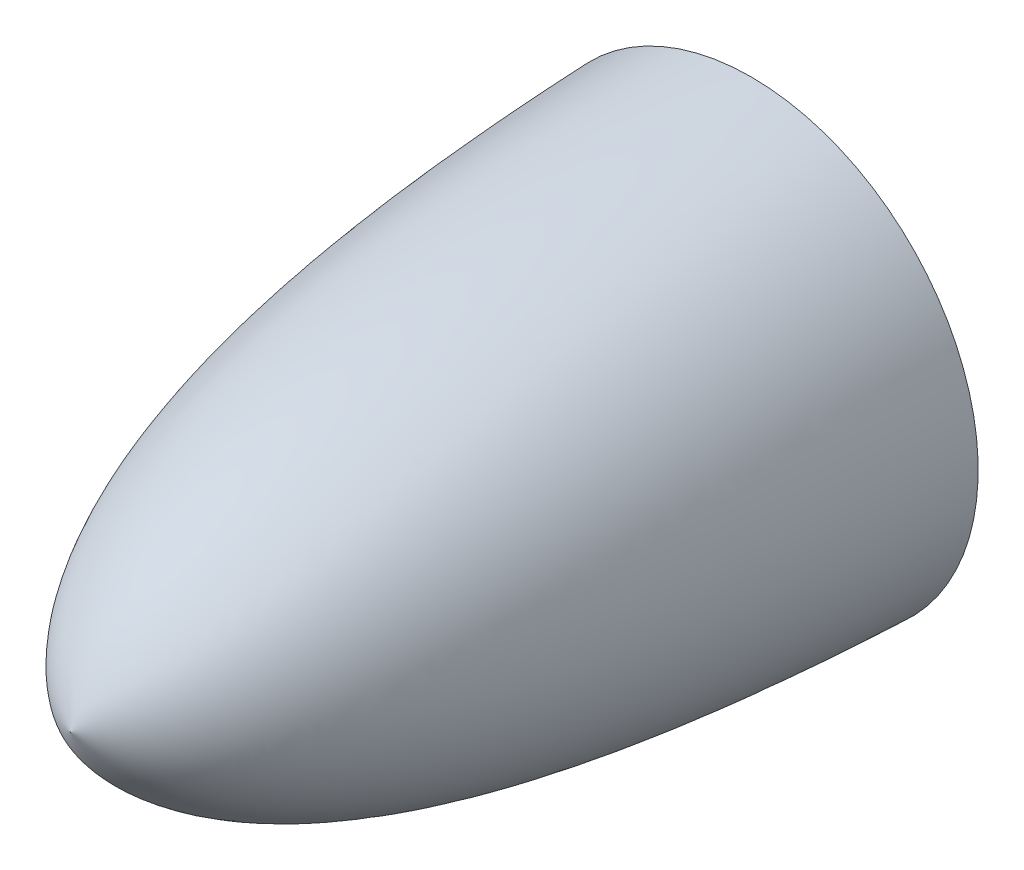
ISO-10303-21;
HEADER;
FILE_DESCRIPTION(('STEP AP214'),'2;1');
FILE_NAME('part.step','',(''),(''),'','','');
FILE_SCHEMA(('AUTOMOTIVE_DESIGN { 1 0 10303 214 1 1 1 1 }'));
ENDSEC;
DATA;
#1=APPLICATION_CONTEXT('core data for automotive mechanical design processes');
#2=APPLICATION_PROTOCOL_DEFINITION('international standard','automotive_design',2000,#1);
#3=PRODUCT_CONTEXT('',#1,'mechanical');
#4=PRODUCT('Part','Part','',(#3));
#5=PRODUCT_RELATED_PRODUCT_CATEGORY('part','',(#4));
#6=PRODUCT_DEFINITION_FORMATION('','',#4);
#7=PRODUCT_DEFINITION_CONTEXT('part definition',#1,'design');
#8=PRODUCT_DEFINITION('design','',#6,#7);
#9=PRODUCT_DEFINITION_SHAPE('','',#8);
#10=(LENGTH_UNIT() NAMED_UNIT(*) SI_UNIT(.MILLI.,.METRE.));
#11=(NAMED_UNIT(*) PLANE_ANGLE_UNIT() SI_UNIT($,.RADIAN.));
#12=(NAMED_UNIT(*) SI_UNIT($,.STERADIAN.) SOLID_ANGLE_UNIT());
#13=UNCERTAINTY_MEASURE_WITH_UNIT(LENGTH_MEASURE(1.E-05),#10,'distance_accuracy_value','');
#14=(GEOMETRIC_REPRESENTATION_CONTEXT(3) GLOBAL_UNCERTAINTY_ASSIGNED_CONTEXT((#13)) GLOBAL_UNIT_ASSIGNED_CONTEXT((#10,
#11,#12)) REPRESENTATION_CONTEXT('',''));
#15=CARTESIAN_POINT('',(0.,0.,0.));
#16=DIRECTION('',(0.,0.,1.));
#17=DIRECTION('',(1.,0.,0.));
#18=AXIS2_PLACEMENT_3D('',#15,#16,#17);
#19=CARTESIAN_POINT('',(0.,0.,29.9999999999998));
#20=CARTESIAN_POINT('',(0.,3.48790698576125,28.7890443158059));
#21=CARTESIAN_POINT('',(1.11022302462516E-13,7.67460204107899,24.5042235951289));
#22=CARTESIAN_POINT('',(0.,9.47357257266086,14.1683201773133));
#23=CARTESIAN_POINT('',(0.,10.0000000000001,0.));
#24=B_SPLINE_CURVE_WITH_KNOTS('',4,(#19,#20,#21,#22,#23),.UNSPECIFIED.,.F.,.F.,(5,5),(0.,1.),.UNSPECIFIED.);
#25=CARTESIAN_POINT('',(0.,0.,0.));
#26=DIRECTION('',(0.,0.,-1.));
#27=AXIS1_PLACEMENT('',#25,#26);
#28=SURFACE_OF_REVOLUTION('',#24,#27);
#29=CARTESIAN_POINT('',(0.,0.,0.));
#30=DIRECTION('',(0.,0.,1.));
#31=DIRECTION('',(0.,-1.00000000000002,0.));
#32=AXIS2_PLACEMENT_3D('',#29,#30,#31);
#33=CIRCLE('',#32,10.);
#34=CARTESIAN_POINT('',(0.,-10.0000000000002,0.));
#35=VERTEX_POINT('',#34);
#36=EDGE_CURVE('E11',#35,#35,#33,.T.);
#37=ORIENTED_EDGE('',*,*,#36,.T.);
#38=EDGE_LOOP('',(#37));
#39=FACE_BOUND('',#38,.T.);
#40=CARTESIAN_POINT('',(0.,0.,29.9999999999998));
#41=VERTEX_POINT('',#40);
#42=VERTEX_LOOP('',#41);
#43=FACE_BOUND('',#42,.T.);
#44=ADVANCED_FACE('F37',(#39,#43),#28,.T.);
#45=CARTESIAN_POINT('',(0.,10.0000000000001,0.));
#46=DIRECTION('',(0.,0.,1.));
#47=DIRECTION('',(0.,1.00000000000002,0.));
#48=AXIS2_PLACEMENT_3D('',#45,#46,#47);
#49=PLANE('',#48);
#50=ORIENTED_EDGE('',*,*,#36,.F.);
#51=EDGE_LOOP('',(#50));
#52=FACE_BOUND('',#51,.T.);
#53=ADVANCED_FACE('F46',(#52),#49,.F.);
#54=CLOSED_SHELL('',(#44,#53));
#55=MANIFOLD_SOLID_BREP('B2',#54);
#56=ADVANCED_BREP_SHAPE_REPRESENTATION('',(#18,#55),#14);
#57=SHAPE_DEFINITION_REPRESENTATION(#9,#56);
ENDSEC;
END-ISO-10303-21;
